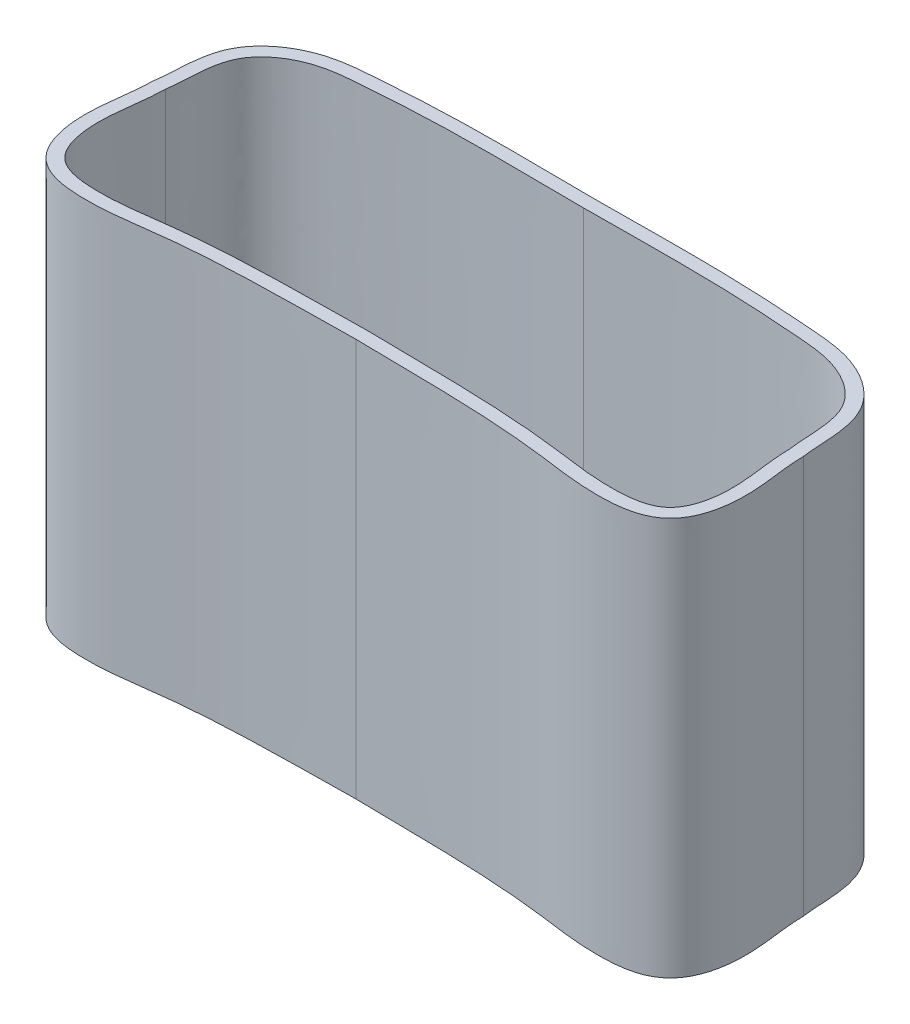
ISO-10303-21;
HEADER;
FILE_DESCRIPTION(('STEP AP214'),'2;1');
FILE_NAME('part.step','',(''),(''),'','','');
FILE_SCHEMA(('AUTOMOTIVE_DESIGN { 1 0 10303 214 1 1 1 1 }'));
ENDSEC;
DATA;
#1=APPLICATION_CONTEXT('core data for automotive mechanical design processes');
#2=APPLICATION_PROTOCOL_DEFINITION('international standard','automotive_design',2000,#1);
#3=PRODUCT_CONTEXT('',#1,'mechanical');
#4=PRODUCT('Part','Part','',(#3));
#5=PRODUCT_RELATED_PRODUCT_CATEGORY('part','',(#4));
#6=PRODUCT_DEFINITION_FORMATION('','',#4);
#7=PRODUCT_DEFINITION_CONTEXT('part definition',#1,'design');
#8=PRODUCT_DEFINITION('design','',#6,#7);
#9=PRODUCT_DEFINITION_SHAPE('','',#8);
#10=(LENGTH_UNIT() NAMED_UNIT(*) SI_UNIT(.MILLI.,.METRE.));
#11=(NAMED_UNIT(*) PLANE_ANGLE_UNIT() SI_UNIT($,.RADIAN.));
#12=(NAMED_UNIT(*) SI_UNIT($,.STERADIAN.) SOLID_ANGLE_UNIT());
#13=UNCERTAINTY_MEASURE_WITH_UNIT(LENGTH_MEASURE(1.E-05),#10,'distance_accuracy_value','');
#14=(GEOMETRIC_REPRESENTATION_CONTEXT(3) GLOBAL_UNCERTAINTY_ASSIGNED_CONTEXT((#13)) GLOBAL_UNIT_ASSIGNED_CONTEXT((#10,
#11,#12)) REPRESENTATION_CONTEXT('',''));
#15=CARTESIAN_POINT('',(0.,0.,0.));
#16=DIRECTION('',(0.,0.,1.));
#17=DIRECTION('',(1.,0.,0.));
#18=AXIS2_PLACEMENT_3D('',#15,#16,#17);
#19=CARTESIAN_POINT('',(-9.14644506381026,60.,23.8608734484924));
#20=DIRECTION('',(0.,1.,0.));
#21=DIRECTION('',(0.,0.,1.));
#22=AXIS2_PLACEMENT_3D('',#19,#20,#21);
#23=PLANE('',#22);
#24=CARTESIAN_POINT('',(-26.970898007073,60.,3.86330264661254));
#25=CARTESIAN_POINT('',(-26.9729428979637,60.,4.0288164435327));
#26=CARTESIAN_POINT('',(-26.9780192916489,60.,4.36443201463222));
#27=CARTESIAN_POINT('',(-27.0026564250693,60.,4.99861982917042));
#28=CARTESIAN_POINT('',(-27.0752629230381,60.,6.10764478008562));
#29=CARTESIAN_POINT('',(-27.3137051551409,60.,8.29030848933366));
#30=CARTESIAN_POINT('',(-27.7589468859035,60.,11.4910012654745));
#31=CARTESIAN_POINT('',(-27.782586990102,60.,15.1901605725524));
#32=CARTESIAN_POINT('',(-27.14794819714,60.,18.391266216099));
#33=CARTESIAN_POINT('',(-26.3413030815387,60.,20.3266120650214));
#34=CARTESIAN_POINT('',(-25.3242603590652,60.,21.7330758456598));
#35=CARTESIAN_POINT('',(-23.9789872703611,60.,22.9682898066028));
#36=CARTESIAN_POINT('',(-22.035946544142,60.,23.8726591792143));
#37=CARTESIAN_POINT('',(-19.6497096098122,60.,24.3453543769289));
#38=CARTESIAN_POINT('',(-17.3394125233007,60.,24.4808856602441));
#39=CARTESIAN_POINT('',(-15.1786343744563,60.,24.4626585691278));
#40=CARTESIAN_POINT('',(-12.3987778674153,60.,24.2827699857221));
#41=CARTESIAN_POINT('',(-9.11557451071777,60.,23.8600554733804));
#42=CARTESIAN_POINT('',(-5.36095380123569,60.,23.3577059092426));
#43=CARTESIAN_POINT('',(-0.236288787435648,60.,22.8892880282917));
#44=CARTESIAN_POINT('',(6.31281147798977,60.,22.5575946816483));
#45=CARTESIAN_POINT('',(12.9150505601679,60.,22.4371378681055));
#46=CARTESIAN_POINT('',(18.1581770494874,60.,22.3743498691185));
#47=CARTESIAN_POINT('',(20.7337888126936,60.,22.3396888090329));
#48=CARTESIAN_POINT('',(22.0272524337294,60.,22.3173387442213));
#49=B_SPLINE_CURVE_WITH_KNOTS('',3,(#24,#25,#26,#27,#28,#29,#30,#31,#32,#33,#34,#35,#36,#37,#38,
#39,#40,#41,#42,#43,#44,#45,#46,#47,#48),.UNSPECIFIED.,.F.,.F.,(4,1,1,1,1,1,1,1,1,1,1,1,1,1,1,1,
1,1,1,1,1,1,4),(-0.00202792715325728,0.00579601207717684,0.0136199513076111,0.0292678297684793,
0.0605635866902159,0.123155100533689,0.185746614377162,0.217042371298899,0.248338128220635,
0.263986006681504,0.279633885142372,0.310929642064108,0.342225398985845,0.373521155907581,
0.404816912829318,0.436112669751055,0.498704183594528,0.561295697438001,0.623887211281474,
0.74907023896842,0.874253266655366,0.93684478049884,0.999436294342313),.UNSPECIFIED.);
#50=CARTESIAN_POINT('',(-26.970898007073,60.,3.86330264661236));
#51=VERTEX_POINT('',#50);
#52=CARTESIAN_POINT('',(22.0272524337294,60.,22.3173387442213));
#53=VERTEX_POINT('',#52);
#54=EDGE_CURVE('E215',#51,#53,#49,.T.);
#55=ORIENTED_EDGE('',*,*,#54,.T.);
#56=CARTESIAN_POINT('',(22.0272524337294,60.,22.3173387442213));
#57=CARTESIAN_POINT('',(23.3207160547652,60.,22.3396888090329));
#58=CARTESIAN_POINT('',(25.8963278179713,60.,22.3743498691185));
#59=CARTESIAN_POINT('',(31.1394543072909,60.,22.4371378681055));
#60=CARTESIAN_POINT('',(37.741693389469,60.,22.5575946816482));
#61=CARTESIAN_POINT('',(44.2907936548945,60.,22.8892880282917));
#62=CARTESIAN_POINT('',(49.4154586686945,60.,23.3577059092426));
#63=CARTESIAN_POINT('',(53.1700793781766,60.,23.8600554733804));
#64=CARTESIAN_POINT('',(56.4532827348741,60.,24.2827699857221));
#65=CARTESIAN_POINT('',(59.2331392419152,60.,24.4626585691278));
#66=CARTESIAN_POINT('',(61.3939173907596,60.,24.4808856602441));
#67=CARTESIAN_POINT('',(63.7042144772711,60.,24.3453543769288));
#68=CARTESIAN_POINT('',(66.0904514116009,60.,23.8726591792143));
#69=CARTESIAN_POINT('',(68.0334921378201,60.,22.9682898066026));
#70=CARTESIAN_POINT('',(69.3787652265241,60.,21.7330758456596));
#71=CARTESIAN_POINT('',(70.3958079489976,60.,20.3266120650212));
#72=CARTESIAN_POINT('',(71.2024530645988,60.,18.3912662160987));
#73=CARTESIAN_POINT('',(71.8370918575607,60.,15.1901605725522));
#74=CARTESIAN_POINT('',(71.8134517533623,60.,11.4910012654743));
#75=CARTESIAN_POINT('',(71.3682100225996,60.,8.29030848933345));
#76=CARTESIAN_POINT('',(71.1297677904968,60.,6.10764478008543));
#77=CARTESIAN_POINT('',(71.0571612925281,60.,4.99861982917022));
#78=CARTESIAN_POINT('',(71.0325241591076,60.,4.36443201463202));
#79=CARTESIAN_POINT('',(71.0274477654225,60.,4.02881644353249));
#80=CARTESIAN_POINT('',(71.0254028745317,60.,3.86330264661232));
#81=B_SPLINE_CURVE_WITH_KNOTS('',3,(#56,#57,#58,#59,#60,#61,#62,#63,#64,#65,#66,#67,#68,#69,#70,
#71,#72,#73,#74,#75,#76,#77,#78,#79,#80),.UNSPECIFIED.,.F.,.F.,(4,1,1,1,1,1,1,1,1,1,1,1,1,1,1,1,
1,1,1,1,1,1,4),(-0.00202792715326053,0.0605635866902129,0.123155100533686,0.248338128220633,
0.373521155907579,0.436112669751053,0.498704183594526,0.561295697437999,0.592591454359736,
0.623887211281473,0.655182968203209,0.686478725124946,0.717774482046683,0.733422360507551,
0.74907023896842,0.780365995890156,0.811661752811893,0.874253266655366,0.936844780498839,
0.968140537420576,0.983788415881444,0.991612355111879,0.999436294342313),.UNSPECIFIED.);
#82=CARTESIAN_POINT('',(71.0254028745317,60.,3.86330264661215));
#83=VERTEX_POINT('',#82);
#84=EDGE_CURVE('E239',#53,#83,#81,.T.);
#85=ORIENTED_EDGE('',*,*,#84,.T.);
#86=CARTESIAN_POINT('',(71.0254028745317,60.,3.86330264661215));
#87=CARTESIAN_POINT('',(71.0156161052474,60.,3.79832753030893));
#88=CARTESIAN_POINT('',(70.9950193187121,60.,3.66347945285498));
#89=CARTESIAN_POINT('',(70.9631548856501,60.,3.43279429917425));
#90=CARTESIAN_POINT('',(70.9102744824119,60.,2.99095650536795));
#91=CARTESIAN_POINT('',(70.8283081004245,60.,2.0606872195467));
#92=CARTESIAN_POINT('',(70.7499174841983,60.,0.579746200413053));
#93=CARTESIAN_POINT('',(70.6265491252842,60.,-1.34235892880504));
#94=CARTESIAN_POINT('',(70.3533008075508,60.,-3.35415466753926));
#95=CARTESIAN_POINT('',(69.7987962478095,60.,-5.40151380072938));
#96=CARTESIAN_POINT('',(68.7414141481887,60.,-7.40871393528843));
#97=CARTESIAN_POINT('',(67.2865102540053,60.,-9.05930671488634));
#98=CARTESIAN_POINT('',(65.0135034737125,60.,-10.8532614538499));
#99=CARTESIAN_POINT('',(61.7327457750889,60.,-12.3970828231125));
#100=CARTESIAN_POINT('',(57.7778243635968,60.,-13.107903004303));
#101=CARTESIAN_POINT('',(54.221753462703,60.,-13.3479903456088));
#102=CARTESIAN_POINT('',(50.6463055836947,60.,-13.6136213949039));
#103=CARTESIAN_POINT('',(47.0515218304342,60.,-13.8117065048051));
#104=CARTESIAN_POINT('',(42.2569258942887,60.,-13.9904019224378));
#105=CARTESIAN_POINT('',(36.2844133958544,60.,-14.069250178539));
#106=CARTESIAN_POINT('',(29.1386865280717,60.,-14.0327407895497));
#107=CARTESIAN_POINT('',(24.3998418289356,60.,-13.9832310277178));
#108=CARTESIAN_POINT('',(22.0272524337292,60.,-13.9677741185538));
#109=B_SPLINE_CURVE_WITH_KNOTS('',3,(#86,#87,#88,#89,#90,#91,#92,#93,#94,#95,#96,#97,#98,#99,
#100,#101,#102,#103,#104,#105,#106,#107,#108),.UNSPECIFIED.,.F.,.F.,(4,1,1,1,1,1,1,1,1,1,1,1,1,
1,1,1,1,1,1,1,4),(-0.00260310689834664,0.0013124159451986,0.00522793878874384,
0.0130589844758344,0.0287210758500155,0.0600452585983777,0.0913694413467399,0.122693624095102,
0.154017806843464,0.185341989591826,0.216666172340189,0.247990355088551,0.310638720585275,
0.373287086082,0.435935451578724,0.498583817075448,0.561232182572173,0.623880548068897,
0.749177279062346,0.874474010055795,0.999770741049243),.UNSPECIFIED.);
#110=CARTESIAN_POINT('',(22.0272524337292,60.,-13.9677741185538));
#111=VERTEX_POINT('',#110);
#112=EDGE_CURVE('E178',#83,#111,#109,.T.);
#113=ORIENTED_EDGE('',*,*,#112,.T.);
#114=CARTESIAN_POINT('',(22.0272524337292,60.,-13.9677741185538));
#115=CARTESIAN_POINT('',(19.6546630385229,60.,-13.9832310277178));
#116=CARTESIAN_POINT('',(14.9158183393867,60.,-14.0327407895497));
#117=CARTESIAN_POINT('',(7.77009147160407,60.,-14.069250178539));
#118=CARTESIAN_POINT('',(1.79757897316978,60.,-13.9904019224378));
#119=CARTESIAN_POINT('',(-2.9970169629757,60.,-13.8117065048051));
#120=CARTESIAN_POINT('',(-6.59180071623621,60.,-13.6136213949039));
#121=CARTESIAN_POINT('',(-10.1672485952445,60.,-13.3479903456088));
#122=CARTESIAN_POINT('',(-13.7233194961383,60.,-13.107903004303));
#123=CARTESIAN_POINT('',(-17.6782409076305,60.,-12.3970828231124));
#124=CARTESIAN_POINT('',(-20.958998606254,60.,-10.8532614538498));
#125=CARTESIAN_POINT('',(-23.2320053865468,60.,-9.05930671488614));
#126=CARTESIAN_POINT('',(-24.6869092807302,60.,-7.40871393528817));
#127=CARTESIAN_POINT('',(-25.7442913803509,60.,-5.40151380072908));
#128=CARTESIAN_POINT('',(-26.2987959400921,60.,-3.35415466753896));
#129=CARTESIAN_POINT('',(-26.5720442578255,60.,-1.34235892880475));
#130=CARTESIAN_POINT('',(-26.6954126167395,60.,0.579746200413319));
#131=CARTESIAN_POINT('',(-26.7738032329658,60.,2.06068721954694));
#132=CARTESIAN_POINT('',(-26.8557696149531,60.,2.99095650536816));
#133=CARTESIAN_POINT('',(-26.9086500181914,60.,3.43279429917445));
#134=CARTESIAN_POINT('',(-26.9405144512533,60.,3.66347945285516));
#135=CARTESIAN_POINT('',(-26.9611112377887,60.,3.79832753030914));
#136=CARTESIAN_POINT('',(-26.970898007073,60.,3.86330264661236));
#137=B_SPLINE_CURVE_WITH_KNOTS('',3,(#114,#115,#116,#117,#118,#119,#120,#121,#122,#123,#124,
#125,#126,#127,#128,#129,#130,#131,#132,#133,#134,#135,#136),.UNSPECIFIED.,.F.,.F.,(4,1,1,1,1,1,
1,1,1,1,1,1,1,1,1,1,1,1,1,1,4),(-0.00260310689835088,0.122693624095098,0.247990355088546,
0.373287086081995,0.435935451578719,0.498583817075444,0.561232182572168,0.623880548068893,
0.686528913565617,0.749177279062341,0.780501461810703,0.811825644559066,0.843149827307428,
0.87447401005579,0.905798192804152,0.937122375552514,0.968446558300876,0.984108649675058,
0.991939695362148,0.995855218205693,0.999770741049239),.UNSPECIFIED.);
#138=EDGE_CURVE('E172',#111,#51,#137,.T.);
#139=ORIENTED_EDGE('',*,*,#138,.T.);
#140=EDGE_LOOP('',(#55,#85,#113,#139));
#141=FACE_BOUND('',#140,.T.);
#142=CARTESIAN_POINT('',(22.0272524337294,60.,20.3170390002326));
#143=CARTESIAN_POINT('',(31.4370404264528,60.,20.480284225347));
#144=CARTESIAN_POINT('',(45.1847190493902,60.,20.3550641778899));
#145=CARTESIAN_POINT('',(59.7114584974997,60.,22.9108639011229));
#146=CARTESIAN_POINT('',(68.5066408467447,60.,21.7473823093946));
#147=CARTESIAN_POINT('',(70.5378688076057,60.,12.7757366696346));
#148=CARTESIAN_POINT('',(69.0735747053428,60.,7.77469269925782));
#149=CARTESIAN_POINT('',(69.0272524337294,60.,4.02536059975168));
#150=B_SPLINE_CURVE_WITH_KNOTS('',3,(#142,#143,#144,#145,#146,#147,#148,#149),.UNSPECIFIED.,.F.,
.F.,(4,1,1,1,1,4),(0.,0.460577101275753,0.627314773885004,0.727155083581898,0.833927342326781,
1.),.UNSPECIFIED.);
#151=CARTESIAN_POINT('',(22.0272524337294,60.,20.3170390002326));
#152=VERTEX_POINT('',#151);
#153=CARTESIAN_POINT('',(69.0272524337294,60.,4.02536059975168));
#154=VERTEX_POINT('',#153);
#155=EDGE_CURVE('E144',#152,#154,#150,.T.);
#156=ORIENTED_EDGE('',*,*,#155,.F.);
#157=CARTESIAN_POINT('',(-24.9727475662706,60.,4.02536059975169));
#158=CARTESIAN_POINT('',(-25.0190698378841,60.,7.77469269925783));
#159=CARTESIAN_POINT('',(-26.4833639401469,60.,12.7757366696346));
#160=CARTESIAN_POINT('',(-24.452135979286,60.,21.7473823093946));
#161=CARTESIAN_POINT('',(-15.6569536300409,60.,22.9108639011229));
#162=CARTESIAN_POINT('',(-1.13021418193149,60.,20.3550641778899));
#163=CARTESIAN_POINT('',(12.617464441006,60.,20.480284225347));
#164=CARTESIAN_POINT('',(22.0272524337294,60.,20.3170390002326));
#165=B_SPLINE_CURVE_WITH_KNOTS('',3,(#157,#158,#159,#160,#161,#162,#163,#164),.UNSPECIFIED.,.F.,
.F.,(4,1,1,1,1,4),(0.,0.166072657673219,0.272844916418102,0.372685226114996,0.539422898724247,
1.),.UNSPECIFIED.);
#166=CARTESIAN_POINT('',(-24.9727475662706,60.,4.02536059975169));
#167=VERTEX_POINT('',#166);
#168=EDGE_CURVE('E119',#167,#152,#165,.T.);
#169=ORIENTED_EDGE('',*,*,#168,.F.);
#170=CARTESIAN_POINT('',(22.0272524337294,60.,-11.9677317700996));
#171=CARTESIAN_POINT('',(13.7373284327958,60.,-12.0216197806085));
#172=CARTESIAN_POINT('',(2.6606438749174,60.,-12.2457397314201));
#173=CARTESIAN_POINT('',(-10.317198482306,60.,-11.3557237692031));
#174=CARTESIAN_POINT('',(-17.6675139859561,60.,-10.7212142322731));
#175=CARTESIAN_POINT('',(-25.2539260955329,60.,-5.88187961093483));
#176=CARTESIAN_POINT('',(-24.5263589552786,60.,1.06175217359983));
#177=CARTESIAN_POINT('',(-24.9727475662706,60.,4.02536059975169));
#178=B_SPLINE_CURVE_WITH_KNOTS('',3,(#170,#171,#172,#173,#174,#175,#176,#177),.UNSPECIFIED.,.F.,
.F.,(4,1,1,1,1,4),(0.,0.437599852774768,0.584929885123265,0.685181564300457,0.829610429903257,
1.),.UNSPECIFIED.);
#179=CARTESIAN_POINT('',(22.0272524337294,60.,-11.9677317700996));
#180=VERTEX_POINT('',#179);
#181=EDGE_CURVE('E109',#180,#167,#178,.T.);
#182=ORIENTED_EDGE('',*,*,#181,.F.);
#183=CARTESIAN_POINT('',(69.0272524337294,60.,4.02536059975168));
#184=CARTESIAN_POINT('',(68.5808638227373,60.,1.06175217359981));
#185=CARTESIAN_POINT('',(69.3084309629916,60.,-5.88187961093483));
#186=CARTESIAN_POINT('',(61.7220188534148,60.,-10.7212142322731));
#187=CARTESIAN_POINT('',(54.3717033497647,60.,-11.3557237692031));
#188=CARTESIAN_POINT('',(41.3938609925413,60.,-12.2457397314201));
#189=CARTESIAN_POINT('',(30.3171764346629,60.,-12.0216197806085));
#190=CARTESIAN_POINT('',(22.0272524337294,60.,-11.9677317700996));
#191=B_SPLINE_CURVE_WITH_KNOTS('',3,(#183,#184,#185,#186,#187,#188,#189,#190),.UNSPECIFIED.,.F.,
.F.,(4,1,1,1,1,4),(0.,0.170389570096743,0.314818435699543,0.415070114876735,0.562400147225232,
1.),.UNSPECIFIED.);
#192=EDGE_CURVE('E275',#154,#180,#191,.T.);
#193=ORIENTED_EDGE('',*,*,#192,.F.);
#194=EDGE_LOOP('',(#156,#169,#182,#193));
#195=FACE_BOUND('',#194,.T.);
#196=ADVANCED_FACE('F35',(#141,#195),#23,.T.);
#197=CARTESIAN_POINT('',(-9.14644506381026,0.,23.8608734484924));
#198=DIRECTION('',(0.,1.,0.));
#199=DIRECTION('',(0.,0.,1.));
#200=AXIS2_PLACEMENT_3D('',#197,#198,#199);
#201=PLANE('',#200);
#202=CARTESIAN_POINT('',(-26.970898007073,0.,3.86330264661254));
#203=CARTESIAN_POINT('',(-26.9729428979637,0.,4.0288164435327));
#204=CARTESIAN_POINT('',(-26.9780192916489,0.,4.36443201463222));
#205=CARTESIAN_POINT('',(-27.0026564250693,0.,4.99861982917042));
#206=CARTESIAN_POINT('',(-27.0752629230381,0.,6.10764478008562));
#207=CARTESIAN_POINT('',(-27.3137051551409,0.,8.29030848933366));
#208=CARTESIAN_POINT('',(-27.7589468859035,0.,11.4910012654745));
#209=CARTESIAN_POINT('',(-27.782586990102,0.,15.1901605725524));
#210=CARTESIAN_POINT('',(-27.14794819714,0.,18.391266216099));
#211=CARTESIAN_POINT('',(-26.3413030815387,0.,20.3266120650214));
#212=CARTESIAN_POINT('',(-25.3242603590652,0.,21.7330758456598));
#213=CARTESIAN_POINT('',(-23.9789872703611,0.,22.9682898066028));
#214=CARTESIAN_POINT('',(-22.035946544142,0.,23.8726591792143));
#215=CARTESIAN_POINT('',(-19.6497096098122,0.,24.3453543769289));
#216=CARTESIAN_POINT('',(-17.3394125233007,0.,24.4808856602441));
#217=CARTESIAN_POINT('',(-15.1786343744563,0.,24.4626585691278));
#218=CARTESIAN_POINT('',(-12.3987778674153,0.,24.2827699857221));
#219=CARTESIAN_POINT('',(-9.11557451071777,0.,23.8600554733804));
#220=CARTESIAN_POINT('',(-5.36095380123569,0.,23.3577059092426));
#221=CARTESIAN_POINT('',(-0.236288787435648,0.,22.8892880282917));
#222=CARTESIAN_POINT('',(6.31281147798977,0.,22.5575946816483));
#223=CARTESIAN_POINT('',(12.9150505601679,0.,22.4371378681055));
#224=CARTESIAN_POINT('',(18.1581770494874,0.,22.3743498691185));
#225=CARTESIAN_POINT('',(20.7337888126936,0.,22.3396888090329));
#226=CARTESIAN_POINT('',(22.0272524337294,0.,22.3173387442213));
#227=B_SPLINE_CURVE_WITH_KNOTS('',3,(#202,#203,#204,#205,#206,#207,#208,#209,#210,#211,#212,
#213,#214,#215,#216,#217,#218,#219,#220,#221,#222,#223,#224,#225,#226),.UNSPECIFIED.,.F.,.F.,(4,
1,1,1,1,1,1,1,1,1,1,1,1,1,1,1,1,1,1,1,1,1,4),(-0.00202792715325728,0.00579601207717684,
0.0136199513076111,0.0292678297684793,0.0605635866902159,0.123155100533689,0.185746614377162,
0.217042371298899,0.248338128220635,0.263986006681504,0.279633885142372,0.310929642064108,
0.342225398985845,0.373521155907581,0.404816912829318,0.436112669751055,0.498704183594528,
0.561295697438001,0.623887211281474,0.74907023896842,0.874253266655366,0.93684478049884,
0.999436294342313),.UNSPECIFIED.);
#228=CARTESIAN_POINT('',(-26.970898007073,0.,3.86330264661236));
#229=VERTEX_POINT('',#228);
#230=CARTESIAN_POINT('',(22.0272524337294,0.,22.3173387442213));
#231=VERTEX_POINT('',#230);
#232=EDGE_CURVE('E183',#229,#231,#227,.T.);
#233=ORIENTED_EDGE('',*,*,#232,.F.);
#234=CARTESIAN_POINT('',(22.0272524337292,0.,-13.9677741185538));
#235=CARTESIAN_POINT('',(19.6546630385229,0.,-13.9832310277178));
#236=CARTESIAN_POINT('',(14.9158183393867,0.,-14.0327407895497));
#237=CARTESIAN_POINT('',(7.77009147160407,0.,-14.069250178539));
#238=CARTESIAN_POINT('',(1.79757897316978,0.,-13.9904019224378));
#239=CARTESIAN_POINT('',(-2.9970169629757,0.,-13.8117065048051));
#240=CARTESIAN_POINT('',(-6.59180071623621,0.,-13.6136213949039));
#241=CARTESIAN_POINT('',(-10.1672485952445,0.,-13.3479903456088));
#242=CARTESIAN_POINT('',(-13.7233194961383,0.,-13.107903004303));
#243=CARTESIAN_POINT('',(-17.6782409076305,0.,-12.3970828231124));
#244=CARTESIAN_POINT('',(-20.958998606254,0.,-10.8532614538498));
#245=CARTESIAN_POINT('',(-23.2320053865468,0.,-9.05930671488614));
#246=CARTESIAN_POINT('',(-24.6869092807302,0.,-7.40871393528817));
#247=CARTESIAN_POINT('',(-25.7442913803509,0.,-5.40151380072908));
#248=CARTESIAN_POINT('',(-26.2987959400921,0.,-3.35415466753896));
#249=CARTESIAN_POINT('',(-26.5720442578255,0.,-1.34235892880475));
#250=CARTESIAN_POINT('',(-26.6954126167395,0.,0.579746200413319));
#251=CARTESIAN_POINT('',(-26.7738032329658,0.,2.06068721954694));
#252=CARTESIAN_POINT('',(-26.8557696149531,0.,2.99095650536816));
#253=CARTESIAN_POINT('',(-26.9086500181914,0.,3.43279429917445));
#254=CARTESIAN_POINT('',(-26.9405144512533,0.,3.66347945285516));
#255=CARTESIAN_POINT('',(-26.9611112377887,0.,3.79832753030914));
#256=CARTESIAN_POINT('',(-26.970898007073,0.,3.86330264661236));
#257=B_SPLINE_CURVE_WITH_KNOTS('',3,(#234,#235,#236,#237,#238,#239,#240,#241,#242,#243,#244,
#245,#246,#247,#248,#249,#250,#251,#252,#253,#254,#255,#256),.UNSPECIFIED.,.F.,.F.,(4,1,1,1,1,1,
1,1,1,1,1,1,1,1,1,1,1,1,1,1,4),(-0.00260310689835088,0.122693624095098,0.247990355088546,
0.373287086081995,0.435935451578719,0.498583817075444,0.561232182572168,0.623880548068893,
0.686528913565617,0.749177279062341,0.780501461810703,0.811825644559066,0.843149827307428,
0.87447401005579,0.905798192804152,0.937122375552514,0.968446558300876,0.984108649675058,
0.991939695362148,0.995855218205693,0.999770741049239),.UNSPECIFIED.);
#258=CARTESIAN_POINT('',(22.0272524337292,0.,-13.9677741185538));
#259=VERTEX_POINT('',#258);
#260=EDGE_CURVE('E207',#259,#229,#257,.T.);
#261=ORIENTED_EDGE('',*,*,#260,.F.);
#262=CARTESIAN_POINT('',(71.0254028745317,0.,3.86330264661215));
#263=CARTESIAN_POINT('',(71.0156161052474,0.,3.79832753030893));
#264=CARTESIAN_POINT('',(70.9950193187121,0.,3.66347945285498));
#265=CARTESIAN_POINT('',(70.9631548856501,0.,3.43279429917425));
#266=CARTESIAN_POINT('',(70.9102744824119,0.,2.99095650536795));
#267=CARTESIAN_POINT('',(70.8283081004245,0.,2.0606872195467));
#268=CARTESIAN_POINT('',(70.7499174841983,0.,0.579746200413053));
#269=CARTESIAN_POINT('',(70.6265491252842,0.,-1.34235892880504));
#270=CARTESIAN_POINT('',(70.3533008075508,0.,-3.35415466753926));
#271=CARTESIAN_POINT('',(69.7987962478095,0.,-5.40151380072938));
#272=CARTESIAN_POINT('',(68.7414141481887,0.,-7.40871393528843));
#273=CARTESIAN_POINT('',(67.2865102540053,0.,-9.05930671488634));
#274=CARTESIAN_POINT('',(65.0135034737125,0.,-10.8532614538499));
#275=CARTESIAN_POINT('',(61.7327457750889,0.,-12.3970828231125));
#276=CARTESIAN_POINT('',(57.7778243635968,0.,-13.107903004303));
#277=CARTESIAN_POINT('',(54.221753462703,0.,-13.3479903456088));
#278=CARTESIAN_POINT('',(50.6463055836947,0.,-13.6136213949039));
#279=CARTESIAN_POINT('',(47.0515218304342,0.,-13.8117065048051));
#280=CARTESIAN_POINT('',(42.2569258942887,0.,-13.9904019224378));
#281=CARTESIAN_POINT('',(36.2844133958544,0.,-14.069250178539));
#282=CARTESIAN_POINT('',(29.1386865280717,0.,-14.0327407895497));
#283=CARTESIAN_POINT('',(24.3998418289356,0.,-13.9832310277178));
#284=CARTESIAN_POINT('',(22.0272524337292,0.,-13.9677741185538));
#285=B_SPLINE_CURVE_WITH_KNOTS('',3,(#262,#263,#264,#265,#266,#267,#268,#269,#270,#271,#272,
#273,#274,#275,#276,#277,#278,#279,#280,#281,#282,#283,#284),.UNSPECIFIED.,.F.,.F.,(4,1,1,1,1,1,
1,1,1,1,1,1,1,1,1,1,1,1,1,1,4),(-0.00260310689834664,0.0013124159451986,0.00522793878874384,
0.0130589844758344,0.0287210758500155,0.0600452585983777,0.0913694413467399,0.122693624095102,
0.154017806843464,0.185341989591826,0.216666172340189,0.247990355088551,0.310638720585275,
0.373287086082,0.435935451578724,0.498583817075448,0.561232182572173,0.623880548068897,
0.749177279062346,0.874474010055795,0.999770741049243),.UNSPECIFIED.);
#286=CARTESIAN_POINT('',(71.0254028745317,0.,3.86330264661215));
#287=VERTEX_POINT('',#286);
#288=EDGE_CURVE('E199',#287,#259,#285,.T.);
#289=ORIENTED_EDGE('',*,*,#288,.F.);
#290=CARTESIAN_POINT('',(22.0272524337294,0.,22.3173387442213));
#291=CARTESIAN_POINT('',(23.3207160547652,0.,22.3396888090329));
#292=CARTESIAN_POINT('',(25.8963278179713,0.,22.3743498691185));
#293=CARTESIAN_POINT('',(31.1394543072909,0.,22.4371378681055));
#294=CARTESIAN_POINT('',(37.741693389469,0.,22.5575946816482));
#295=CARTESIAN_POINT('',(44.2907936548945,0.,22.8892880282917));
#296=CARTESIAN_POINT('',(49.4154586686945,0.,23.3577059092426));
#297=CARTESIAN_POINT('',(53.1700793781766,0.,23.8600554733804));
#298=CARTESIAN_POINT('',(56.4532827348741,0.,24.2827699857221));
#299=CARTESIAN_POINT('',(59.2331392419152,0.,24.4626585691278));
#300=CARTESIAN_POINT('',(61.3939173907596,0.,24.4808856602441));
#301=CARTESIAN_POINT('',(63.7042144772711,0.,24.3453543769288));
#302=CARTESIAN_POINT('',(66.0904514116009,0.,23.8726591792143));
#303=CARTESIAN_POINT('',(68.0334921378201,0.,22.9682898066026));
#304=CARTESIAN_POINT('',(69.3787652265241,0.,21.7330758456596));
#305=CARTESIAN_POINT('',(70.3958079489976,0.,20.3266120650212));
#306=CARTESIAN_POINT('',(71.2024530645988,0.,18.3912662160987));
#307=CARTESIAN_POINT('',(71.8370918575607,0.,15.1901605725522));
#308=CARTESIAN_POINT('',(71.8134517533623,0.,11.4910012654743));
#309=CARTESIAN_POINT('',(71.3682100225996,0.,8.29030848933345));
#310=CARTESIAN_POINT('',(71.1297677904968,0.,6.10764478008543));
#311=CARTESIAN_POINT('',(71.0571612925281,0.,4.99861982917022));
#312=CARTESIAN_POINT('',(71.0325241591076,0.,4.36443201463202));
#313=CARTESIAN_POINT('',(71.0274477654225,0.,4.02881644353249));
#314=CARTESIAN_POINT('',(71.0254028745317,0.,3.86330264661232));
#315=B_SPLINE_CURVE_WITH_KNOTS('',3,(#290,#291,#292,#293,#294,#295,#296,#297,#298,#299,#300,
#301,#302,#303,#304,#305,#306,#307,#308,#309,#310,#311,#312,#313,#314),.UNSPECIFIED.,.F.,.F.,(4,
1,1,1,1,1,1,1,1,1,1,1,1,1,1,1,1,1,1,1,1,1,4),(-0.00202792715326053,0.0605635866902129,
0.123155100533686,0.248338128220633,0.373521155907579,0.436112669751053,0.498704183594526,
0.561295697437999,0.592591454359736,0.623887211281473,0.655182968203209,0.686478725124946,
0.717774482046683,0.733422360507551,0.74907023896842,0.780365995890156,0.811661752811893,
0.874253266655366,0.936844780498839,0.968140537420576,0.983788415881444,0.991612355111879,
0.999436294342313),.UNSPECIFIED.);
#316=EDGE_CURVE('E191',#231,#287,#315,.T.);
#317=ORIENTED_EDGE('',*,*,#316,.F.);
#318=EDGE_LOOP('',(#233,#261,#289,#317));
#319=FACE_BOUND('',#318,.T.);
#320=ADVANCED_FACE('F161',(#319),#201,.F.);
#321=DIRECTION('',(0.,-1.,0.));
#322=VECTOR('',#321,1.);
#323=SURFACE_OF_LINEAR_EXTRUSION('',#49,#322);
#324=DIRECTION('',(0.,-1.,0.));
#325=VECTOR('',#324,1.);
#326=CARTESIAN_POINT('',(-26.970898007073,60.,3.86330264661236));
#327=LINE('',#326,#325);
#328=EDGE_CURVE('E177',#51,#229,#327,.T.);
#329=ORIENTED_EDGE('',*,*,#328,.T.);
#330=ORIENTED_EDGE('',*,*,#232,.T.);
#331=DIRECTION('',(0.,-1.,0.));
#332=VECTOR('',#331,1.);
#333=CARTESIAN_POINT('',(22.0272524337294,60.,22.3173387442213));
#334=LINE('',#333,#332);
#335=EDGE_CURVE('E40',#53,#231,#334,.T.);
#336=ORIENTED_EDGE('',*,*,#335,.F.);
#337=ORIENTED_EDGE('',*,*,#54,.F.);
#338=EDGE_LOOP('',(#329,#330,#336,#337));
#339=FACE_BOUND('',#338,.T.);
#340=ADVANCED_FACE('F37',(#339),#323,.F.);
#341=DIRECTION('',(0.,-1.,0.));
#342=VECTOR('',#341,1.);
#343=SURFACE_OF_LINEAR_EXTRUSION('',#81,#342);
#344=ORIENTED_EDGE('',*,*,#335,.T.);
#345=ORIENTED_EDGE('',*,*,#316,.T.);
#346=DIRECTION('',(0.,-1.,0.));
#347=VECTOR('',#346,1.);
#348=CARTESIAN_POINT('',(71.0254028745317,60.,3.86330264661215));
#349=LINE('',#348,#347);
#350=EDGE_CURVE('E228',#83,#287,#349,.T.);
#351=ORIENTED_EDGE('',*,*,#350,.F.);
#352=ORIENTED_EDGE('',*,*,#84,.F.);
#353=EDGE_LOOP('',(#344,#345,#351,#352));
#354=FACE_BOUND('',#353,.T.);
#355=ADVANCED_FACE('F237',(#354),#343,.F.);
#356=DIRECTION('',(0.,-1.,0.));
#357=VECTOR('',#356,1.);
#358=SURFACE_OF_LINEAR_EXTRUSION('',#109,#357);
#359=ORIENTED_EDGE('',*,*,#350,.T.);
#360=ORIENTED_EDGE('',*,*,#288,.T.);
#361=DIRECTION('',(0.,-1.,0.));
#362=VECTOR('',#361,1.);
#363=CARTESIAN_POINT('',(22.0272524337292,60.,-13.9677741185538));
#364=LINE('',#363,#362);
#365=EDGE_CURVE('E225',#111,#259,#364,.T.);
#366=ORIENTED_EDGE('',*,*,#365,.F.);
#367=ORIENTED_EDGE('',*,*,#112,.F.);
#368=EDGE_LOOP('',(#359,#360,#366,#367));
#369=FACE_BOUND('',#368,.T.);
#370=ADVANCED_FACE('F169',(#369),#358,.F.);
#371=DIRECTION('',(0.,-1.,0.));
#372=VECTOR('',#371,1.);
#373=SURFACE_OF_LINEAR_EXTRUSION('',#137,#372);
#374=ORIENTED_EDGE('',*,*,#365,.T.);
#375=ORIENTED_EDGE('',*,*,#260,.T.);
#376=ORIENTED_EDGE('',*,*,#328,.F.);
#377=ORIENTED_EDGE('',*,*,#138,.F.);
#378=EDGE_LOOP('',(#374,#375,#376,#377));
#379=FACE_BOUND('',#378,.T.);
#380=ADVANCED_FACE('F157',(#379),#373,.F.);
#381=DIRECTION('',(0.,-1.,0.));
#382=VECTOR('',#381,1.);
#383=SURFACE_OF_LINEAR_EXTRUSION('',#165,#382);
#384=CARTESIAN_POINT('',(-24.9727475662706,3.,4.02536059975169));
#385=CARTESIAN_POINT('',(-25.0190698378841,3.,7.77469269925783));
#386=CARTESIAN_POINT('',(-26.4833639401469,3.,12.7757366696346));
#387=CARTESIAN_POINT('',(-24.452135979286,3.,21.7473823093946));
#388=CARTESIAN_POINT('',(-15.6569536300409,3.,22.9108639011229));
#389=CARTESIAN_POINT('',(-1.13021418193149,3.,20.3550641778899));
#390=CARTESIAN_POINT('',(12.617464441006,3.,20.480284225347));
#391=CARTESIAN_POINT('',(22.0272524337294,3.,20.3170390002326));
#392=B_SPLINE_CURVE_WITH_KNOTS('',3,(#384,#385,#386,#387,#388,#389,#390,#391),.UNSPECIFIED.,.F.,
.F.,(4,1,1,1,1,4),(0.,0.166072657673219,0.272844916418102,0.372685226114996,0.539422898724247,
1.),.UNSPECIFIED.);
#393=CARTESIAN_POINT('',(-24.9727475662706,3.,4.02536059975169));
#394=VERTEX_POINT('',#393);
#395=CARTESIAN_POINT('',(22.0272524337294,3.,20.3170390002326));
#396=VERTEX_POINT('',#395);
#397=EDGE_CURVE('E115',#394,#396,#392,.T.);
#398=ORIENTED_EDGE('',*,*,#397,.F.);
#399=DIRECTION('',(0.,-1.,0.));
#400=VECTOR('',#399,1.);
#401=CARTESIAN_POINT('',(-24.9727475662706,60.,4.02536059975169));
#402=LINE('',#401,#400);
#403=EDGE_CURVE('E105',#167,#394,#402,.T.);
#404=ORIENTED_EDGE('',*,*,#403,.F.);
#405=ORIENTED_EDGE('',*,*,#168,.T.);
#406=DIRECTION('',(0.,-1.,0.));
#407=VECTOR('',#406,1.);
#408=CARTESIAN_POINT('',(22.0272524337294,60.,20.3170390002326));
#409=LINE('',#408,#407);
#410=EDGE_CURVE('E117',#152,#396,#409,.T.);
#411=ORIENTED_EDGE('',*,*,#410,.T.);
#412=EDGE_LOOP('',(#398,#404,#405,#411));
#413=FACE_BOUND('',#412,.T.);
#414=ADVANCED_FACE('F116',(#413),#383,.T.);
#415=DIRECTION('',(0.,-1.,0.));
#416=VECTOR('',#415,1.);
#417=SURFACE_OF_LINEAR_EXTRUSION('',#150,#416);
#418=CARTESIAN_POINT('',(22.0272524337294,3.,20.3170390002326));
#419=CARTESIAN_POINT('',(31.4370404264528,3.,20.480284225347));
#420=CARTESIAN_POINT('',(45.1847190493902,3.,20.3550641778899));
#421=CARTESIAN_POINT('',(59.7114584974997,3.,22.9108639011229));
#422=CARTESIAN_POINT('',(68.5066408467447,3.,21.7473823093946));
#423=CARTESIAN_POINT('',(70.5378688076057,3.,12.7757366696346));
#424=CARTESIAN_POINT('',(69.0735747053428,3.,7.77469269925782));
#425=CARTESIAN_POINT('',(69.0272524337294,3.,4.02536059975168));
#426=B_SPLINE_CURVE_WITH_KNOTS('',3,(#418,#419,#420,#421,#422,#423,#424,#425),.UNSPECIFIED.,.F.,
.F.,(4,1,1,1,1,4),(0.,0.460577101275753,0.627314773885004,0.727155083581898,0.833927342326781,
1.),.UNSPECIFIED.);
#427=CARTESIAN_POINT('',(69.0272524337294,3.,4.02536059975168));
#428=VERTEX_POINT('',#427);
#429=EDGE_CURVE('E53',#396,#428,#426,.T.);
#430=ORIENTED_EDGE('',*,*,#429,.F.);
#431=ORIENTED_EDGE('',*,*,#410,.F.);
#432=ORIENTED_EDGE('',*,*,#155,.T.);
#433=DIRECTION('',(0.,-1.,0.));
#434=VECTOR('',#433,1.);
#435=CARTESIAN_POINT('',(69.0272524337294,60.,4.02536059975168));
#436=LINE('',#435,#434);
#437=EDGE_CURVE('E269',#154,#428,#436,.T.);
#438=ORIENTED_EDGE('',*,*,#437,.T.);
#439=EDGE_LOOP('',(#430,#431,#432,#438));
#440=FACE_BOUND('',#439,.T.);
#441=ADVANCED_FACE('F156',(#440),#417,.T.);
#442=DIRECTION('',(0.,-1.,0.));
#443=VECTOR('',#442,1.);
#444=SURFACE_OF_LINEAR_EXTRUSION('',#191,#443);
#445=CARTESIAN_POINT('',(69.0272524337294,3.,4.02536059975168));
#446=CARTESIAN_POINT('',(68.5808638227373,3.,1.06175217359981));
#447=CARTESIAN_POINT('',(69.3084309629916,3.,-5.88187961093483));
#448=CARTESIAN_POINT('',(61.7220188534148,3.,-10.7212142322731));
#449=CARTESIAN_POINT('',(54.3717033497647,3.,-11.3557237692031));
#450=CARTESIAN_POINT('',(41.3938609925413,3.,-12.2457397314201));
#451=CARTESIAN_POINT('',(30.3171764346629,3.,-12.0216197806085));
#452=CARTESIAN_POINT('',(22.0272524337294,3.,-11.9677317700996));
#453=B_SPLINE_CURVE_WITH_KNOTS('',3,(#445,#446,#447,#448,#449,#450,#451,#452),.UNSPECIFIED.,.F.,
.F.,(4,1,1,1,1,4),(0.,0.170389570096743,0.314818435699543,0.415070114876735,0.562400147225232,
1.),.UNSPECIFIED.);
#454=CARTESIAN_POINT('',(22.0272524337294,3.,-11.9677317700996));
#455=VERTEX_POINT('',#454);
#456=EDGE_CURVE('E61',#428,#455,#453,.T.);
#457=ORIENTED_EDGE('',*,*,#456,.F.);
#458=ORIENTED_EDGE('',*,*,#437,.F.);
#459=ORIENTED_EDGE('',*,*,#192,.T.);
#460=DIRECTION('',(0.,-1.,0.));
#461=VECTOR('',#460,1.);
#462=CARTESIAN_POINT('',(22.0272524337294,60.,-11.9677317700996));
#463=LINE('',#462,#461);
#464=EDGE_CURVE('E112',#180,#455,#463,.T.);
#465=ORIENTED_EDGE('',*,*,#464,.T.);
#466=EDGE_LOOP('',(#457,#458,#459,#465));
#467=FACE_BOUND('',#466,.T.);
#468=ADVANCED_FACE('F285',(#467),#444,.T.);
#469=DIRECTION('',(0.,-1.,0.));
#470=VECTOR('',#469,1.);
#471=SURFACE_OF_LINEAR_EXTRUSION('',#178,#470);
#472=CARTESIAN_POINT('',(22.0272524337294,3.,-11.9677317700996));
#473=CARTESIAN_POINT('',(13.7373284327958,3.,-12.0216197806085));
#474=CARTESIAN_POINT('',(2.6606438749174,3.,-12.2457397314201));
#475=CARTESIAN_POINT('',(-10.317198482306,3.,-11.3557237692031));
#476=CARTESIAN_POINT('',(-17.6675139859561,3.,-10.7212142322731));
#477=CARTESIAN_POINT('',(-25.2539260955329,3.,-5.88187961093483));
#478=CARTESIAN_POINT('',(-24.5263589552786,3.,1.06175217359983));
#479=CARTESIAN_POINT('',(-24.9727475662706,3.,4.02536059975169));
#480=B_SPLINE_CURVE_WITH_KNOTS('',3,(#472,#473,#474,#475,#476,#477,#478,#479),.UNSPECIFIED.,.F.,
.F.,(4,1,1,1,1,4),(0.,0.437599852774768,0.584929885123265,0.685181564300457,0.829610429903257,
1.),.UNSPECIFIED.);
#481=EDGE_CURVE('E11',#455,#394,#480,.T.);
#482=ORIENTED_EDGE('',*,*,#481,.F.);
#483=ORIENTED_EDGE('',*,*,#464,.F.);
#484=ORIENTED_EDGE('',*,*,#181,.T.);
#485=ORIENTED_EDGE('',*,*,#403,.T.);
#486=EDGE_LOOP('',(#482,#483,#484,#485));
#487=FACE_BOUND('',#486,.T.);
#488=ADVANCED_FACE('F107',(#487),#471,.T.);
#489=CARTESIAN_POINT('',(-9.14644506381027,3.,23.8608734484924));
#490=DIRECTION('',(0.,1.,0.));
#491=DIRECTION('',(0.,0.,1.));
#492=AXIS2_PLACEMENT_3D('',#489,#490,#491);
#493=PLANE('',#492);
#494=ORIENTED_EDGE('',*,*,#481,.T.);
#495=ORIENTED_EDGE('',*,*,#397,.T.);
#496=ORIENTED_EDGE('',*,*,#429,.T.);
#497=ORIENTED_EDGE('',*,*,#456,.T.);
#498=EDGE_LOOP('',(#494,#495,#496,#497));
#499=FACE_BOUND('',#498,.T.);
#500=ADVANCED_FACE('F121',(#499),#493,.T.);
#501=CLOSED_SHELL('',(#196,#320,#340,#355,#370,#380,#414,#441,#468,#488,#500));
#502=MANIFOLD_SOLID_BREP('B2',#501);
#503=ADVANCED_BREP_SHAPE_REPRESENTATION('',(#18,#502),#14);
#504=SHAPE_DEFINITION_REPRESENTATION(#9,#503);
ENDSEC;
END-ISO-10303-21;
